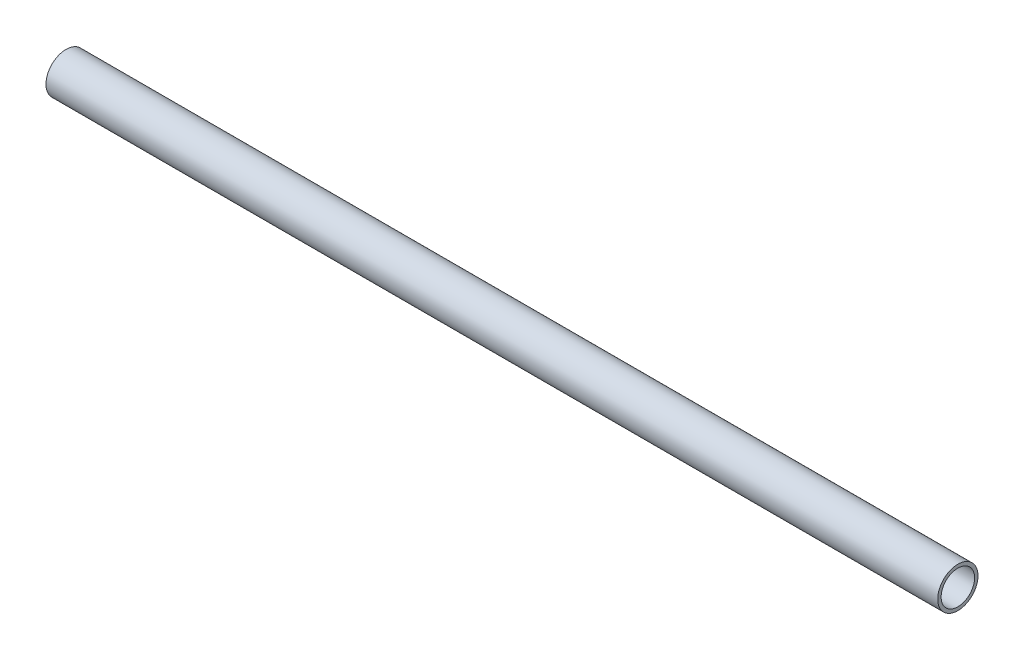
ISO-10303-21;
HEADER;
FILE_DESCRIPTION(('STEP AP214'),'2;1');
FILE_NAME('part.step','',(''),(''),'','','');
FILE_SCHEMA(('AUTOMOTIVE_DESIGN { 1 0 10303 214 1 1 1 1 }'));
ENDSEC;
DATA;
#1=APPLICATION_CONTEXT('core data for automotive mechanical design processes');
#2=APPLICATION_PROTOCOL_DEFINITION('international standard','automotive_design',2000,#1);
#3=PRODUCT_CONTEXT('',#1,'mechanical');
#4=PRODUCT('Part','Part','',(#3));
#5=PRODUCT_RELATED_PRODUCT_CATEGORY('part','',(#4));
#6=PRODUCT_DEFINITION_FORMATION('','',#4);
#7=PRODUCT_DEFINITION_CONTEXT('part definition',#1,'design');
#8=PRODUCT_DEFINITION('design','',#6,#7);
#9=PRODUCT_DEFINITION_SHAPE('','',#8);
#10=(LENGTH_UNIT() NAMED_UNIT(*) SI_UNIT(.MILLI.,.METRE.));
#11=(NAMED_UNIT(*) PLANE_ANGLE_UNIT() SI_UNIT($,.RADIAN.));
#12=(NAMED_UNIT(*) SI_UNIT($,.STERADIAN.) SOLID_ANGLE_UNIT());
#13=UNCERTAINTY_MEASURE_WITH_UNIT(LENGTH_MEASURE(1.E-05),#10,'distance_accuracy_value','');
#14=(GEOMETRIC_REPRESENTATION_CONTEXT(3) GLOBAL_UNCERTAINTY_ASSIGNED_CONTEXT((#13)) GLOBAL_UNIT_ASSIGNED_CONTEXT((#10,
#11,#12)) REPRESENTATION_CONTEXT('',''));
#15=CARTESIAN_POINT('',(0.,0.,0.));
#16=DIRECTION('',(0.,0.,1.));
#17=DIRECTION('',(1.,0.,0.));
#18=AXIS2_PLACEMENT_3D('',#15,#16,#17);
#19=CARTESIAN_POINT('',(473.077,28.575,1958.975));
#20=DIRECTION('',(1.,0.,0.));
#21=DIRECTION('',(0.,0.,-1.));
#22=AXIS2_PLACEMENT_3D('',#19,#20,#21);
#23=CYLINDRICAL_SURFACE('',#22,17.526);
#24=CARTESIAN_POINT('',(473.075,28.575,1958.975));
#25=DIRECTION('',(1.,0.,0.));
#26=DIRECTION('',(0.,0.,-1.));
#27=AXIS2_PLACEMENT_3D('',#24,#25,#26);
#28=CIRCLE('',#27,17.526);
#29=CARTESIAN_POINT('',(473.075,28.575,1941.449));
#30=VERTEX_POINT('',#29);
#31=EDGE_CURVE('E24',#30,#30,#28,.F.);
#32=ORIENTED_EDGE('',*,*,#31,.F.);
#33=EDGE_LOOP('',(#32));
#34=FACE_BOUND('',#33,.T.);
#35=CARTESIAN_POINT('',(-460.375,28.575,1958.975));
#36=DIRECTION('',(1.,0.,0.));
#37=DIRECTION('',(0.,0.,-1.));
#38=AXIS2_PLACEMENT_3D('',#35,#36,#37);
#39=CIRCLE('',#38,17.526);
#40=CARTESIAN_POINT('',(-460.375,28.575,1941.449));
#41=VERTEX_POINT('',#40);
#42=EDGE_CURVE('E15',#41,#41,#39,.F.);
#43=ORIENTED_EDGE('',*,*,#42,.T.);
#44=EDGE_LOOP('',(#43));
#45=FACE_BOUND('',#44,.T.);
#46=ADVANCED_FACE('F12',(#34,#45),#23,.F.);
#47=CARTESIAN_POINT('',(-460.375,28.575,993.775));
#48=DIRECTION('',(1.,0.,0.));
#49=DIRECTION('',(0.,0.,-1.));
#50=AXIS2_PLACEMENT_3D('',#47,#48,#49);
#51=PLANE('',#50);
#52=CARTESIAN_POINT('',(-460.375,28.575,1958.975));
#53=DIRECTION('',(1.,0.,0.));
#54=DIRECTION('',(0.,0.,-1.));
#55=AXIS2_PLACEMENT_3D('',#52,#53,#54);
#56=CIRCLE('',#55,21.082);
#57=CARTESIAN_POINT('',(-460.375,28.575,1937.893));
#58=VERTEX_POINT('',#57);
#59=EDGE_CURVE('E19',#58,#58,#56,.T.);
#60=ORIENTED_EDGE('',*,*,#59,.F.);
#61=EDGE_LOOP('',(#60));
#62=FACE_BOUND('',#61,.T.);
#63=ORIENTED_EDGE('',*,*,#42,.F.);
#64=EDGE_LOOP('',(#63));
#65=FACE_BOUND('',#64,.T.);
#66=ADVANCED_FACE('F33',(#62,#65),#51,.F.);
#67=CARTESIAN_POINT('',(473.075,38.1,990.6));
#68=DIRECTION('',(1.,0.,0.));
#69=DIRECTION('',(0.,0.,-1.));
#70=AXIS2_PLACEMENT_3D('',#67,#68,#69);
#71=PLANE('',#70);
#72=ORIENTED_EDGE('',*,*,#31,.T.);
#73=EDGE_LOOP('',(#72));
#74=FACE_BOUND('',#73,.T.);
#75=CARTESIAN_POINT('',(473.075,28.575,1958.975));
#76=DIRECTION('',(1.,0.,0.));
#77=DIRECTION('',(0.,0.,-1.));
#78=AXIS2_PLACEMENT_3D('',#75,#76,#77);
#79=CIRCLE('',#78,21.082);
#80=CARTESIAN_POINT('',(473.075,28.575,1937.893));
#81=VERTEX_POINT('',#80);
#82=EDGE_CURVE('E8',#81,#81,#79,.F.);
#83=ORIENTED_EDGE('',*,*,#82,.F.);
#84=EDGE_LOOP('',(#83));
#85=FACE_BOUND('',#84,.T.);
#86=ADVANCED_FACE('F35',(#74,#85),#71,.T.);
#87=CARTESIAN_POINT('',(473.077,28.575,1958.975));
#88=DIRECTION('',(1.,0.,0.));
#89=DIRECTION('',(0.,0.,-1.));
#90=AXIS2_PLACEMENT_3D('',#87,#88,#89);
#91=CYLINDRICAL_SURFACE('',#90,21.082);
#92=ORIENTED_EDGE('',*,*,#82,.T.);
#93=EDGE_LOOP('',(#92));
#94=FACE_BOUND('',#93,.T.);
#95=ORIENTED_EDGE('',*,*,#59,.T.);
#96=EDGE_LOOP('',(#95));
#97=FACE_BOUND('',#96,.T.);
#98=ADVANCED_FACE('F42',(#94,#97),#91,.T.);
#99=CLOSED_SHELL('',(#46,#66,#86,#98));
#100=MANIFOLD_SOLID_BREP('B1',#99);
#101=ADVANCED_BREP_SHAPE_REPRESENTATION('',(#18,#100),#14);
#102=SHAPE_DEFINITION_REPRESENTATION(#9,#101);
ENDSEC;
END-ISO-10303-21;
